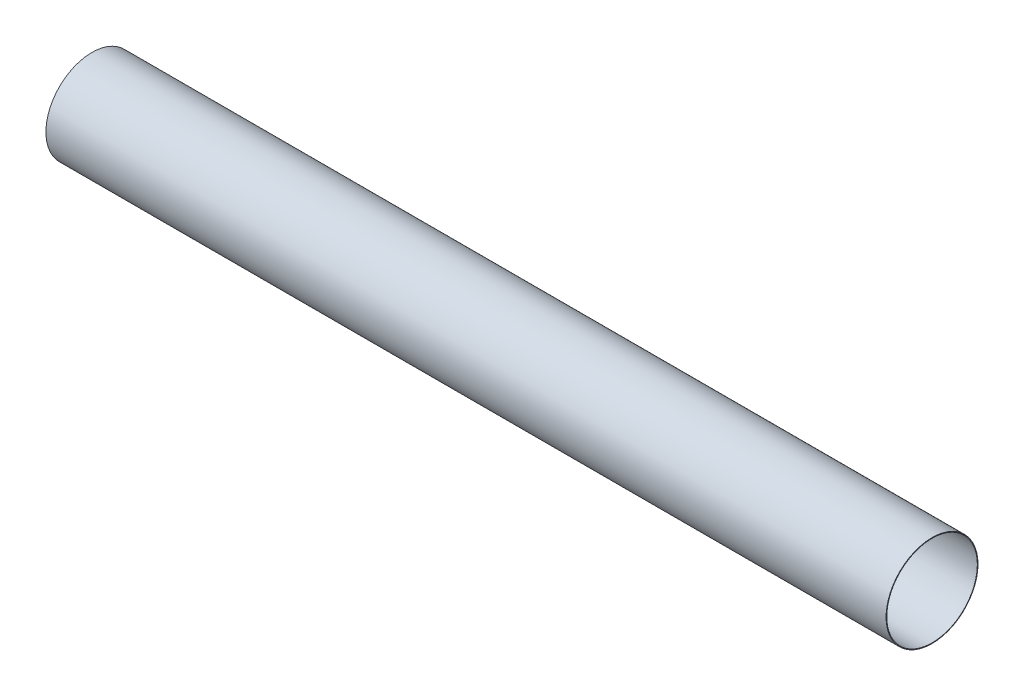
ISO-10303-21;
HEADER;
FILE_DESCRIPTION(('STEP AP214'),'2;1');
FILE_NAME('part.step','',(''),(''),'','','');
FILE_SCHEMA(('AUTOMOTIVE_DESIGN { 1 0 10303 214 1 1 1 1 }'));
ENDSEC;
DATA;
#1=APPLICATION_CONTEXT('core data for automotive mechanical design processes');
#2=APPLICATION_PROTOCOL_DEFINITION('international standard','automotive_design',2000,#1);
#3=PRODUCT_CONTEXT('',#1,'mechanical');
#4=PRODUCT('Part','Part','',(#3));
#5=PRODUCT_RELATED_PRODUCT_CATEGORY('part','',(#4));
#6=PRODUCT_DEFINITION_FORMATION('','',#4);
#7=PRODUCT_DEFINITION_CONTEXT('part definition',#1,'design');
#8=PRODUCT_DEFINITION('design','',#6,#7);
#9=PRODUCT_DEFINITION_SHAPE('','',#8);
#10=(LENGTH_UNIT() NAMED_UNIT(*) SI_UNIT(.MILLI.,.METRE.));
#11=(NAMED_UNIT(*) PLANE_ANGLE_UNIT() SI_UNIT($,.RADIAN.));
#12=(NAMED_UNIT(*) SI_UNIT($,.STERADIAN.) SOLID_ANGLE_UNIT());
#13=UNCERTAINTY_MEASURE_WITH_UNIT(LENGTH_MEASURE(1.E-05),#10,'distance_accuracy_value','');
#14=(GEOMETRIC_REPRESENTATION_CONTEXT(3) GLOBAL_UNCERTAINTY_ASSIGNED_CONTEXT((#13)) GLOBAL_UNIT_ASSIGNED_CONTEXT((#10,
#11,#12)) REPRESENTATION_CONTEXT('',''));
#15=CARTESIAN_POINT('',(0.,0.,0.));
#16=DIRECTION('',(0.,0.,1.));
#17=DIRECTION('',(1.,0.,0.));
#18=AXIS2_PLACEMENT_3D('',#15,#16,#17);
#19=CARTESIAN_POINT('',(1625.6,0.,0.));
#20=DIRECTION('',(1.,0.,0.));
#21=DIRECTION('',(0.,0.,-1.));
#22=AXIS2_PLACEMENT_3D('',#19,#20,#21);
#23=PLANE('',#22);
#24=CARTESIAN_POINT('',(1625.6,0.,0.));
#25=DIRECTION('',(1.,0.,0.));
#26=DIRECTION('',(0.,0.,-1.));
#27=AXIS2_PLACEMENT_3D('',#24,#25,#26);
#28=CIRCLE('',#27,88.9);
#29=CARTESIAN_POINT('',(1625.6,0.,-88.9));
#30=VERTEX_POINT('',#29);
#31=EDGE_CURVE('E10',#30,#30,#28,.T.);
#32=ORIENTED_EDGE('',*,*,#31,.T.);
#33=EDGE_LOOP('',(#32));
#34=FACE_BOUND('',#33,.T.);
#35=CARTESIAN_POINT('',(1625.6,0.,0.));
#36=DIRECTION('',(1.,0.,0.));
#37=DIRECTION('',(0.,0.,-1.));
#38=AXIS2_PLACEMENT_3D('',#35,#36,#37);
#39=CIRCLE('',#38,87.63);
#40=CARTESIAN_POINT('',(1625.6,0.,-87.63));
#41=VERTEX_POINT('',#40);
#42=EDGE_CURVE('E45',#41,#41,#39,.T.);
#43=ORIENTED_EDGE('',*,*,#42,.F.);
#44=EDGE_LOOP('',(#43));
#45=FACE_BOUND('',#44,.T.);
#46=ADVANCED_FACE('F34',(#34,#45),#23,.T.);
#47=CARTESIAN_POINT('',(0.,0.,0.));
#48=DIRECTION('',(1.,0.,0.));
#49=DIRECTION('',(0.,0.,-1.));
#50=AXIS2_PLACEMENT_3D('',#47,#48,#49);
#51=PLANE('',#50);
#52=CARTESIAN_POINT('',(0.,0.,0.));
#53=DIRECTION('',(1.,0.,0.));
#54=DIRECTION('',(0.,0.,-1.));
#55=AXIS2_PLACEMENT_3D('',#52,#53,#54);
#56=CIRCLE('',#55,88.9);
#57=CARTESIAN_POINT('',(0.,0.,-88.9));
#58=VERTEX_POINT('',#57);
#59=EDGE_CURVE('E38',#58,#58,#56,.T.);
#60=ORIENTED_EDGE('',*,*,#59,.F.);
#61=EDGE_LOOP('',(#60));
#62=FACE_BOUND('',#61,.T.);
#63=CARTESIAN_POINT('',(0.,0.,0.));
#64=DIRECTION('',(1.,0.,0.));
#65=DIRECTION('',(0.,0.,-1.));
#66=AXIS2_PLACEMENT_3D('',#63,#64,#65);
#67=CIRCLE('',#66,87.63);
#68=CARTESIAN_POINT('',(0.,0.,-87.63));
#69=VERTEX_POINT('',#68);
#70=EDGE_CURVE('E47',#69,#69,#67,.T.);
#71=ORIENTED_EDGE('',*,*,#70,.T.);
#72=EDGE_LOOP('',(#71));
#73=FACE_BOUND('',#72,.T.);
#74=ADVANCED_FACE('F57',(#62,#73),#51,.F.);
#75=CARTESIAN_POINT('',(1625.6,0.,0.));
#76=DIRECTION('',(-1.,0.,0.));
#77=DIRECTION('',(0.,0.,1.));
#78=AXIS2_PLACEMENT_3D('',#75,#76,#77);
#79=CYLINDRICAL_SURFACE('',#78,88.9);
#80=ORIENTED_EDGE('',*,*,#31,.F.);
#81=EDGE_LOOP('',(#80));
#82=FACE_BOUND('',#81,.T.);
#83=ORIENTED_EDGE('',*,*,#59,.T.);
#84=EDGE_LOOP('',(#83));
#85=FACE_BOUND('',#84,.T.);
#86=ADVANCED_FACE('F36',(#82,#85),#79,.T.);
#87=CARTESIAN_POINT('',(1625.6,0.,0.));
#88=DIRECTION('',(-1.,0.,0.));
#89=DIRECTION('',(0.,0.,1.));
#90=AXIS2_PLACEMENT_3D('',#87,#88,#89);
#91=CYLINDRICAL_SURFACE('',#90,87.63);
#92=ORIENTED_EDGE('',*,*,#42,.T.);
#93=EDGE_LOOP('',(#92));
#94=FACE_BOUND('',#93,.T.);
#95=ORIENTED_EDGE('',*,*,#70,.F.);
#96=EDGE_LOOP('',(#95));
#97=FACE_BOUND('',#96,.T.);
#98=ADVANCED_FACE('F53',(#94,#97),#91,.F.);
#99=CLOSED_SHELL('',(#46,#74,#86,#98));
#100=MANIFOLD_SOLID_BREP('B2',#99);
#101=ADVANCED_BREP_SHAPE_REPRESENTATION('',(#18,#100),#14);
#102=SHAPE_DEFINITION_REPRESENTATION(#9,#101);
ENDSEC;
END-ISO-10303-21;
